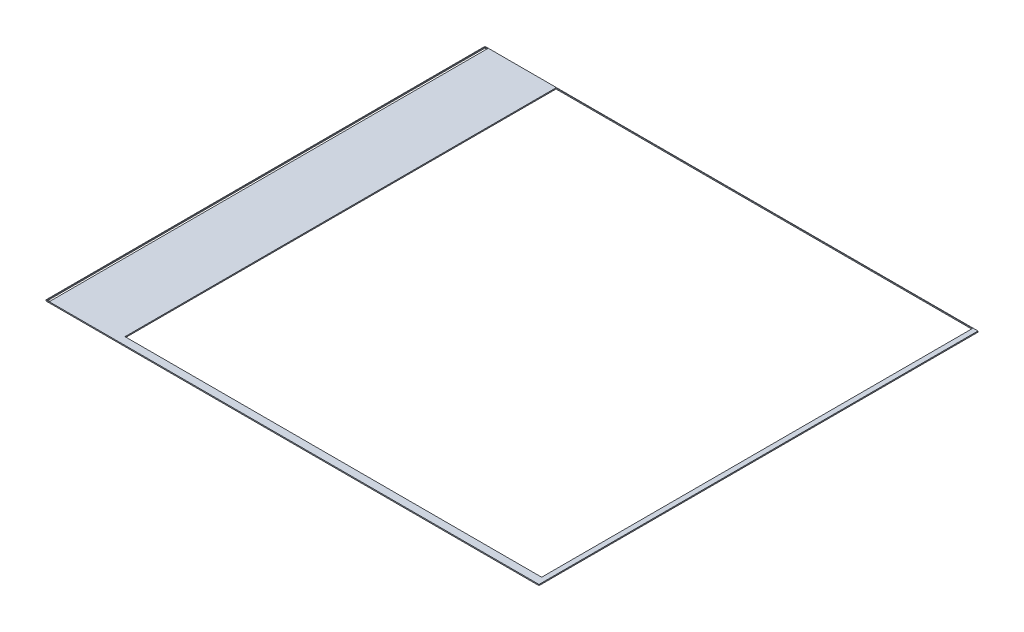
ISO-10303-21;
HEADER;
FILE_DESCRIPTION(('STEP AP214'),'2;1');
FILE_NAME('part.step','',(''),(''),'','','');
FILE_SCHEMA(('AUTOMOTIVE_DESIGN { 1 0 10303 214 1 1 1 1 }'));
ENDSEC;
DATA;
#1=APPLICATION_CONTEXT('core data for automotive mechanical design processes');
#2=APPLICATION_PROTOCOL_DEFINITION('international standard','automotive_design',2000,#1);
#3=PRODUCT_CONTEXT('',#1,'mechanical');
#4=PRODUCT('Part','Part','',(#3));
#5=PRODUCT_RELATED_PRODUCT_CATEGORY('part','',(#4));
#6=PRODUCT_DEFINITION_FORMATION('','',#4);
#7=PRODUCT_DEFINITION_CONTEXT('part definition',#1,'design');
#8=PRODUCT_DEFINITION('design','',#6,#7);
#9=PRODUCT_DEFINITION_SHAPE('','',#8);
#10=(LENGTH_UNIT() NAMED_UNIT(*) SI_UNIT(.MILLI.,.METRE.));
#11=(NAMED_UNIT(*) PLANE_ANGLE_UNIT() SI_UNIT($,.RADIAN.));
#12=(NAMED_UNIT(*) SI_UNIT($,.STERADIAN.) SOLID_ANGLE_UNIT());
#13=UNCERTAINTY_MEASURE_WITH_UNIT(LENGTH_MEASURE(1.E-05),#10,'distance_accuracy_value','');
#14=(GEOMETRIC_REPRESENTATION_CONTEXT(3) GLOBAL_UNCERTAINTY_ASSIGNED_CONTEXT((#13)) GLOBAL_UNIT_ASSIGNED_CONTEXT((#10,
#11,#12)) REPRESENTATION_CONTEXT('',''));
#15=CARTESIAN_POINT('',(0.,0.,0.));
#16=DIRECTION('',(0.,0.,1.));
#17=DIRECTION('',(1.,0.,0.));
#18=AXIS2_PLACEMENT_3D('',#15,#16,#17);
#19=CARTESIAN_POINT('',(-11.365,0.05,-10.12));
#20=DIRECTION('',(1.,0.,0.));
#21=DIRECTION('',(0.,0.,-1.));
#22=AXIS2_PLACEMENT_3D('',#19,#20,#21);
#23=PLANE('',#22);
#24=DIRECTION('',(0.,0.,1.));
#25=VECTOR('',#24,1.);
#26=CARTESIAN_POINT('',(-11.365,0.,-10.12));
#27=LINE('',#26,#25);
#28=CARTESIAN_POINT('',(-11.365,0.,-10.12));
#29=VERTEX_POINT('',#28);
#30=CARTESIAN_POINT('',(-11.365,0.,10.12));
#31=VERTEX_POINT('',#30);
#32=EDGE_CURVE('E182',#29,#31,#27,.T.);
#33=ORIENTED_EDGE('',*,*,#32,.T.);
#34=DIRECTION('',(0.,-1.,0.));
#35=VECTOR('',#34,1.);
#36=CARTESIAN_POINT('',(-11.365,0.05,10.12));
#37=LINE('',#36,#35);
#38=CARTESIAN_POINT('',(-11.365,0.05,10.12));
#39=VERTEX_POINT('',#38);
#40=EDGE_CURVE('E11',#39,#31,#37,.T.);
#41=ORIENTED_EDGE('',*,*,#40,.F.);
#42=DIRECTION('',(0.,0.,1.));
#43=VECTOR('',#42,1.);
#44=CARTESIAN_POINT('',(-11.365,0.05,-10.12));
#45=LINE('',#44,#43);
#46=CARTESIAN_POINT('',(-11.365,0.05,-10.12));
#47=VERTEX_POINT('',#46);
#48=EDGE_CURVE('E189',#47,#39,#45,.T.);
#49=ORIENTED_EDGE('',*,*,#48,.F.);
#50=DIRECTION('',(0.,-1.,0.));
#51=VECTOR('',#50,1.);
#52=CARTESIAN_POINT('',(-11.365,0.05,-10.12));
#53=LINE('',#52,#51);
#54=EDGE_CURVE('E199',#47,#29,#53,.T.);
#55=ORIENTED_EDGE('',*,*,#54,.T.);
#56=EDGE_LOOP('',(#33,#41,#49,#55));
#57=FACE_BOUND('',#56,.T.);
#58=ADVANCED_FACE('F32',(#57),#23,.F.);
#59=CARTESIAN_POINT('',(-11.365,0.05,10.12));
#60=DIRECTION('',(0.,0.,-1.));
#61=DIRECTION('',(-1.,0.,0.));
#62=AXIS2_PLACEMENT_3D('',#59,#60,#61);
#63=PLANE('',#62);
#64=DIRECTION('',(1.,0.,0.));
#65=VECTOR('',#64,1.);
#66=CARTESIAN_POINT('',(-11.365,0.,10.12));
#67=LINE('',#66,#65);
#68=CARTESIAN_POINT('',(11.365,0.,10.12));
#69=VERTEX_POINT('',#68);
#70=EDGE_CURVE('E202',#31,#69,#67,.T.);
#71=ORIENTED_EDGE('',*,*,#70,.T.);
#72=DIRECTION('',(0.,-1.,0.));
#73=VECTOR('',#72,1.);
#74=CARTESIAN_POINT('',(11.365,0.05,10.12));
#75=LINE('',#74,#73);
#76=CARTESIAN_POINT('',(11.365,0.05,10.12));
#77=VERTEX_POINT('',#76);
#78=EDGE_CURVE('E39',#77,#69,#75,.T.);
#79=ORIENTED_EDGE('',*,*,#78,.F.);
#80=DIRECTION('',(1.,0.,0.));
#81=VECTOR('',#80,1.);
#82=CARTESIAN_POINT('',(-11.365,0.05,10.12));
#83=LINE('',#82,#81);
#84=EDGE_CURVE('E192',#39,#77,#83,.T.);
#85=ORIENTED_EDGE('',*,*,#84,.F.);
#86=ORIENTED_EDGE('',*,*,#40,.T.);
#87=EDGE_LOOP('',(#71,#79,#85,#86));
#88=FACE_BOUND('',#87,.T.);
#89=ADVANCED_FACE('F231',(#88),#63,.F.);
#90=CARTESIAN_POINT('',(11.365,0.05,-10.12));
#91=DIRECTION('',(-1.,0.,0.));
#92=DIRECTION('',(0.,0.,1.));
#93=AXIS2_PLACEMENT_3D('',#90,#91,#92);
#94=PLANE('',#93);
#95=DIRECTION('',(0.,0.,-1.));
#96=VECTOR('',#95,1.);
#97=CARTESIAN_POINT('',(11.365,0.,-10.12));
#98=LINE('',#97,#96);
#99=CARTESIAN_POINT('',(11.365,0.,-10.12));
#100=VERTEX_POINT('',#99);
#101=EDGE_CURVE('E204',#69,#100,#98,.T.);
#102=ORIENTED_EDGE('',*,*,#101,.T.);
#103=DIRECTION('',(0.,-1.,0.));
#104=VECTOR('',#103,1.);
#105=CARTESIAN_POINT('',(11.365,0.05,-10.12));
#106=LINE('',#105,#104);
#107=CARTESIAN_POINT('',(11.365,0.05,-10.12));
#108=VERTEX_POINT('',#107);
#109=EDGE_CURVE('E209',#108,#100,#106,.T.);
#110=ORIENTED_EDGE('',*,*,#109,.F.);
#111=DIRECTION('',(0.,0.,-1.));
#112=VECTOR('',#111,1.);
#113=CARTESIAN_POINT('',(11.365,0.05,-10.12));
#114=LINE('',#113,#112);
#115=EDGE_CURVE('E195',#77,#108,#114,.T.);
#116=ORIENTED_EDGE('',*,*,#115,.F.);
#117=ORIENTED_EDGE('',*,*,#78,.T.);
#118=EDGE_LOOP('',(#102,#110,#116,#117));
#119=FACE_BOUND('',#118,.T.);
#120=ADVANCED_FACE('F216',(#119),#94,.F.);
#121=CARTESIAN_POINT('',(-11.365,0.05,-10.12));
#122=DIRECTION('',(0.,0.,1.));
#123=DIRECTION('',(1.,0.,0.));
#124=AXIS2_PLACEMENT_3D('',#121,#122,#123);
#125=PLANE('',#124);
#126=DIRECTION('',(-1.,0.,0.));
#127=VECTOR('',#126,1.);
#128=CARTESIAN_POINT('',(-11.365,0.,-10.12));
#129=LINE('',#128,#127);
#130=EDGE_CURVE('E193',#100,#29,#129,.T.);
#131=ORIENTED_EDGE('',*,*,#130,.T.);
#132=ORIENTED_EDGE('',*,*,#54,.F.);
#133=DIRECTION('',(-1.,0.,0.));
#134=VECTOR('',#133,1.);
#135=CARTESIAN_POINT('',(-11.365,0.05,-10.12));
#136=LINE('',#135,#134);
#137=EDGE_CURVE('E197',#108,#47,#136,.T.);
#138=ORIENTED_EDGE('',*,*,#137,.F.);
#139=ORIENTED_EDGE('',*,*,#109,.T.);
#140=EDGE_LOOP('',(#131,#132,#138,#139));
#141=FACE_BOUND('',#140,.T.);
#142=ADVANCED_FACE('F225',(#141),#125,.F.);
#143=CARTESIAN_POINT('',(-11.365,0.05,10.12));
#144=DIRECTION('',(0.,1.,0.));
#145=DIRECTION('',(0.,0.,1.));
#146=AXIS2_PLACEMENT_3D('',#143,#144,#145);
#147=PLANE('',#146);
#148=DIRECTION('',(0.,0.,-1.));
#149=VECTOR('',#148,1.);
#150=CARTESIAN_POINT('',(-8.0718,0.05,-10.101375));
#151=LINE('',#150,#149);
#152=CARTESIAN_POINT('',(-8.0718,0.05,9.770625));
#153=VERTEX_POINT('',#152);
#154=CARTESIAN_POINT('',(-8.0718,0.05,-10.101375));
#155=VERTEX_POINT('',#154);
#156=EDGE_CURVE('E122',#153,#155,#151,.T.);
#157=ORIENTED_EDGE('',*,*,#156,.T.);
#158=DIRECTION('',(1.,0.,0.));
#159=VECTOR('',#158,1.);
#160=CARTESIAN_POINT('',(11.1378,0.05,-10.101375));
#161=LINE('',#160,#159);
#162=CARTESIAN_POINT('',(11.1378,0.05,-10.101375));
#163=VERTEX_POINT('',#162);
#164=EDGE_CURVE('E131',#155,#163,#161,.T.);
#165=ORIENTED_EDGE('',*,*,#164,.T.);
#166=DIRECTION('',(0.,0.,1.));
#167=VECTOR('',#166,1.);
#168=CARTESIAN_POINT('',(11.1378,0.05,9.770625));
#169=LINE('',#168,#167);
#170=CARTESIAN_POINT('',(11.1378,0.05,9.770625));
#171=VERTEX_POINT('',#170);
#172=EDGE_CURVE('E46',#163,#171,#169,.T.);
#173=ORIENTED_EDGE('',*,*,#172,.T.);
#174=DIRECTION('',(-1.,0.,0.));
#175=VECTOR('',#174,1.);
#176=CARTESIAN_POINT('',(-8.0718,0.05,9.770625));
#177=LINE('',#176,#175);
#178=EDGE_CURVE('E128',#171,#153,#177,.T.);
#179=ORIENTED_EDGE('',*,*,#178,.T.);
#180=EDGE_LOOP('',(#157,#165,#173,#179));
#181=FACE_BOUND('',#180,.T.);
#182=DIRECTION('',(0.,0.,-1.));
#183=VECTOR('',#182,1.);
#184=CARTESIAN_POINT('',(-11.3446,0.05,-10.09685));
#185=LINE('',#184,#183);
#186=CARTESIAN_POINT('',(-11.3446,0.05,10.08815));
#187=VERTEX_POINT('',#186);
#188=CARTESIAN_POINT('',(-11.3446,0.05,-10.09685));
#189=VERTEX_POINT('',#188);
#190=EDGE_CURVE('E157',#187,#189,#185,.T.);
#191=ORIENTED_EDGE('',*,*,#190,.T.);
#192=DIRECTION('',(1.,0.,0.));
#193=VECTOR('',#192,1.);
#194=CARTESIAN_POINT('',(-11.2146,0.05,-10.09685));
#195=LINE('',#194,#193);
#196=CARTESIAN_POINT('',(-11.2146,0.05,-10.09685));
#197=VERTEX_POINT('',#196);
#198=EDGE_CURVE('E160',#189,#197,#195,.T.);
#199=ORIENTED_EDGE('',*,*,#198,.T.);
#200=DIRECTION('',(0.,0.,1.));
#201=VECTOR('',#200,1.);
#202=CARTESIAN_POINT('',(-11.2146,0.05,10.08815));
#203=LINE('',#202,#201);
#204=CARTESIAN_POINT('',(-11.2146,0.05,10.08815));
#205=VERTEX_POINT('',#204);
#206=EDGE_CURVE('E164',#197,#205,#203,.T.);
#207=ORIENTED_EDGE('',*,*,#206,.T.);
#208=DIRECTION('',(-1.,0.,0.));
#209=VECTOR('',#208,1.);
#210=CARTESIAN_POINT('',(-11.3446,0.05,10.08815));
#211=LINE('',#210,#209);
#212=EDGE_CURVE('E167',#205,#187,#211,.T.);
#213=ORIENTED_EDGE('',*,*,#212,.T.);
#214=EDGE_LOOP('',(#191,#199,#207,#213));
#215=FACE_BOUND('',#214,.T.);
#216=ORIENTED_EDGE('',*,*,#48,.T.);
#217=ORIENTED_EDGE('',*,*,#84,.T.);
#218=ORIENTED_EDGE('',*,*,#115,.T.);
#219=ORIENTED_EDGE('',*,*,#137,.T.);
#220=EDGE_LOOP('',(#216,#217,#218,#219));
#221=FACE_BOUND('',#220,.T.);
#222=ADVANCED_FACE('F135',(#181,#215,#221),#147,.T.);
#223=CARTESIAN_POINT('',(-11.365,0.,10.12));
#224=DIRECTION('',(0.,1.,0.));
#225=DIRECTION('',(0.,0.,1.));
#226=AXIS2_PLACEMENT_3D('',#223,#224,#225);
#227=PLANE('',#226);
#228=DIRECTION('',(1.,0.,0.));
#229=VECTOR('',#228,1.);
#230=CARTESIAN_POINT('',(11.1378,0.,-10.101375));
#231=LINE('',#230,#229);
#232=CARTESIAN_POINT('',(-8.0718,0.,-10.101375));
#233=VERTEX_POINT('',#232);
#234=CARTESIAN_POINT('',(11.1378,0.,-10.101375));
#235=VERTEX_POINT('',#234);
#236=EDGE_CURVE('E147',#233,#235,#231,.T.);
#237=ORIENTED_EDGE('',*,*,#236,.F.);
#238=DIRECTION('',(0.,0.,-1.));
#239=VECTOR('',#238,1.);
#240=CARTESIAN_POINT('',(-8.0718,0.,-10.101375));
#241=LINE('',#240,#239);
#242=CARTESIAN_POINT('',(-8.0718,0.,9.770625));
#243=VERTEX_POINT('',#242);
#244=EDGE_CURVE('E54',#243,#233,#241,.T.);
#245=ORIENTED_EDGE('',*,*,#244,.F.);
#246=DIRECTION('',(-1.,0.,0.));
#247=VECTOR('',#246,1.);
#248=CARTESIAN_POINT('',(-8.0718,0.,9.770625));
#249=LINE('',#248,#247);
#250=CARTESIAN_POINT('',(11.1378,0.,9.770625));
#251=VERTEX_POINT('',#250);
#252=EDGE_CURVE('E138',#251,#243,#249,.T.);
#253=ORIENTED_EDGE('',*,*,#252,.F.);
#254=DIRECTION('',(0.,0.,1.));
#255=VECTOR('',#254,1.);
#256=CARTESIAN_POINT('',(11.1378,0.,9.770625));
#257=LINE('',#256,#255);
#258=EDGE_CURVE('E141',#235,#251,#257,.T.);
#259=ORIENTED_EDGE('',*,*,#258,.F.);
#260=EDGE_LOOP('',(#237,#245,#253,#259));
#261=FACE_BOUND('',#260,.T.);
#262=DIRECTION('',(1.,0.,0.));
#263=VECTOR('',#262,1.);
#264=CARTESIAN_POINT('',(-11.2146,0.,-10.09685));
#265=LINE('',#264,#263);
#266=CARTESIAN_POINT('',(-11.3446,0.,-10.09685));
#267=VERTEX_POINT('',#266);
#268=CARTESIAN_POINT('',(-11.2146,0.,-10.09685));
#269=VERTEX_POINT('',#268);
#270=EDGE_CURVE('E172',#267,#269,#265,.T.);
#271=ORIENTED_EDGE('',*,*,#270,.F.);
#272=DIRECTION('',(0.,0.,-1.));
#273=VECTOR('',#272,1.);
#274=CARTESIAN_POINT('',(-11.3446,0.,-10.09685));
#275=LINE('',#274,#273);
#276=CARTESIAN_POINT('',(-11.3446,0.,10.08815));
#277=VERTEX_POINT('',#276);
#278=EDGE_CURVE('E153',#277,#267,#275,.T.);
#279=ORIENTED_EDGE('',*,*,#278,.F.);
#280=DIRECTION('',(-1.,0.,0.));
#281=VECTOR('',#280,1.);
#282=CARTESIAN_POINT('',(-11.3446,0.,10.08815));
#283=LINE('',#282,#281);
#284=CARTESIAN_POINT('',(-11.2146,0.,10.08815));
#285=VERTEX_POINT('',#284);
#286=EDGE_CURVE('E161',#285,#277,#283,.T.);
#287=ORIENTED_EDGE('',*,*,#286,.F.);
#288=DIRECTION('',(0.,0.,1.));
#289=VECTOR('',#288,1.);
#290=CARTESIAN_POINT('',(-11.2146,0.,10.08815));
#291=LINE('',#290,#289);
#292=EDGE_CURVE('E175',#269,#285,#291,.T.);
#293=ORIENTED_EDGE('',*,*,#292,.F.);
#294=EDGE_LOOP('',(#271,#279,#287,#293));
#295=FACE_BOUND('',#294,.T.);
#296=ORIENTED_EDGE('',*,*,#32,.F.);
#297=ORIENTED_EDGE('',*,*,#130,.F.);
#298=ORIENTED_EDGE('',*,*,#101,.F.);
#299=ORIENTED_EDGE('',*,*,#70,.F.);
#300=EDGE_LOOP('',(#296,#297,#298,#299));
#301=FACE_BOUND('',#300,.T.);
#302=ADVANCED_FACE('F222',(#261,#295,#301),#227,.F.);
#303=CARTESIAN_POINT('',(-11.3446,0.05,-10.09685));
#304=DIRECTION('',(-1.,0.,0.));
#305=DIRECTION('',(0.,0.,1.));
#306=AXIS2_PLACEMENT_3D('',#303,#304,#305);
#307=PLANE('',#306);
#308=ORIENTED_EDGE('',*,*,#278,.T.);
#309=DIRECTION('',(0.,-1.,0.));
#310=VECTOR('',#309,1.);
#311=CARTESIAN_POINT('',(-11.3446,0.05,-10.09685));
#312=LINE('',#311,#310);
#313=EDGE_CURVE('E170',#189,#267,#312,.T.);
#314=ORIENTED_EDGE('',*,*,#313,.F.);
#315=ORIENTED_EDGE('',*,*,#190,.F.);
#316=DIRECTION('',(0.,-1.,0.));
#317=VECTOR('',#316,1.);
#318=CARTESIAN_POINT('',(-11.3446,0.05,10.08815));
#319=LINE('',#318,#317);
#320=EDGE_CURVE('E180',#187,#277,#319,.T.);
#321=ORIENTED_EDGE('',*,*,#320,.T.);
#322=EDGE_LOOP('',(#308,#314,#315,#321));
#323=FACE_BOUND('',#322,.T.);
#324=ADVANCED_FACE('F243',(#323),#307,.F.);
#325=CARTESIAN_POINT('',(-11.3446,0.05,10.08815));
#326=DIRECTION('',(0.,0.,1.));
#327=DIRECTION('',(1.,0.,0.));
#328=AXIS2_PLACEMENT_3D('',#325,#326,#327);
#329=PLANE('',#328);
#330=ORIENTED_EDGE('',*,*,#286,.T.);
#331=ORIENTED_EDGE('',*,*,#320,.F.);
#332=ORIENTED_EDGE('',*,*,#212,.F.);
#333=DIRECTION('',(0.,-1.,0.));
#334=VECTOR('',#333,1.);
#335=CARTESIAN_POINT('',(-11.2146,0.05,10.08815));
#336=LINE('',#335,#334);
#337=EDGE_CURVE('E183',#205,#285,#336,.T.);
#338=ORIENTED_EDGE('',*,*,#337,.T.);
#339=EDGE_LOOP('',(#330,#331,#332,#338));
#340=FACE_BOUND('',#339,.T.);
#341=ADVANCED_FACE('F249',(#340),#329,.F.);
#342=CARTESIAN_POINT('',(-11.2146,0.05,10.08815));
#343=DIRECTION('',(1.,0.,0.));
#344=DIRECTION('',(0.,0.,-1.));
#345=AXIS2_PLACEMENT_3D('',#342,#343,#344);
#346=PLANE('',#345);
#347=ORIENTED_EDGE('',*,*,#292,.T.);
#348=ORIENTED_EDGE('',*,*,#337,.F.);
#349=ORIENTED_EDGE('',*,*,#206,.F.);
#350=DIRECTION('',(0.,-1.,0.));
#351=VECTOR('',#350,1.);
#352=CARTESIAN_POINT('',(-11.2146,0.05,-10.09685));
#353=LINE('',#352,#351);
#354=EDGE_CURVE('E185',#197,#269,#353,.T.);
#355=ORIENTED_EDGE('',*,*,#354,.T.);
#356=EDGE_LOOP('',(#347,#348,#349,#355));
#357=FACE_BOUND('',#356,.T.);
#358=ADVANCED_FACE('F254',(#357),#346,.F.);
#359=CARTESIAN_POINT('',(-11.2146,0.05,-10.09685));
#360=DIRECTION('',(0.,0.,-1.));
#361=DIRECTION('',(-1.,0.,0.));
#362=AXIS2_PLACEMENT_3D('',#359,#360,#361);
#363=PLANE('',#362);
#364=ORIENTED_EDGE('',*,*,#270,.T.);
#365=ORIENTED_EDGE('',*,*,#354,.F.);
#366=ORIENTED_EDGE('',*,*,#198,.F.);
#367=ORIENTED_EDGE('',*,*,#313,.T.);
#368=EDGE_LOOP('',(#364,#365,#366,#367));
#369=FACE_BOUND('',#368,.T.);
#370=ADVANCED_FACE('F251',(#369),#363,.F.);
#371=CARTESIAN_POINT('',(-8.0718,0.05,-10.101375));
#372=DIRECTION('',(-1.,0.,0.));
#373=DIRECTION('',(0.,0.,1.));
#374=AXIS2_PLACEMENT_3D('',#371,#372,#373);
#375=PLANE('',#374);
#376=ORIENTED_EDGE('',*,*,#244,.T.);
#377=DIRECTION('',(0.,-1.,0.));
#378=VECTOR('',#377,1.);
#379=CARTESIAN_POINT('',(-8.0718,0.05,-10.101375));
#380=LINE('',#379,#378);
#381=EDGE_CURVE('E118',#155,#233,#380,.T.);
#382=ORIENTED_EDGE('',*,*,#381,.F.);
#383=ORIENTED_EDGE('',*,*,#156,.F.);
#384=DIRECTION('',(0.,-1.,0.));
#385=VECTOR('',#384,1.);
#386=CARTESIAN_POINT('',(-8.0718,0.05,9.770625));
#387=LINE('',#386,#385);
#388=EDGE_CURVE('E151',#153,#243,#387,.T.);
#389=ORIENTED_EDGE('',*,*,#388,.T.);
#390=EDGE_LOOP('',(#376,#382,#383,#389));
#391=FACE_BOUND('',#390,.T.);
#392=ADVANCED_FACE('F120',(#391),#375,.F.);
#393=CARTESIAN_POINT('',(-8.0718,0.05,9.770625));
#394=DIRECTION('',(0.,0.,1.));
#395=DIRECTION('',(1.,0.,0.));
#396=AXIS2_PLACEMENT_3D('',#393,#394,#395);
#397=PLANE('',#396);
#398=ORIENTED_EDGE('',*,*,#252,.T.);
#399=ORIENTED_EDGE('',*,*,#388,.F.);
#400=ORIENTED_EDGE('',*,*,#178,.F.);
#401=DIRECTION('',(0.,-1.,0.));
#402=VECTOR('',#401,1.);
#403=CARTESIAN_POINT('',(11.1378,0.05,9.770625));
#404=LINE('',#403,#402);
#405=EDGE_CURVE('E154',#171,#251,#404,.T.);
#406=ORIENTED_EDGE('',*,*,#405,.T.);
#407=EDGE_LOOP('',(#398,#399,#400,#406));
#408=FACE_BOUND('',#407,.T.);
#409=ADVANCED_FACE('F264',(#408),#397,.F.);
#410=CARTESIAN_POINT('',(11.1378,0.05,9.770625));
#411=DIRECTION('',(1.,0.,0.));
#412=DIRECTION('',(0.,0.,-1.));
#413=AXIS2_PLACEMENT_3D('',#410,#411,#412);
#414=PLANE('',#413);
#415=ORIENTED_EDGE('',*,*,#258,.T.);
#416=ORIENTED_EDGE('',*,*,#405,.F.);
#417=ORIENTED_EDGE('',*,*,#172,.F.);
#418=DIRECTION('',(0.,-1.,0.));
#419=VECTOR('',#418,1.);
#420=CARTESIAN_POINT('',(11.1378,0.05,-10.101375));
#421=LINE('',#420,#419);
#422=EDGE_CURVE('E127',#163,#235,#421,.T.);
#423=ORIENTED_EDGE('',*,*,#422,.T.);
#424=EDGE_LOOP('',(#415,#416,#417,#423));
#425=FACE_BOUND('',#424,.T.);
#426=ADVANCED_FACE('F267',(#425),#414,.F.);
#427=CARTESIAN_POINT('',(11.1378,0.05,-10.101375));
#428=DIRECTION('',(0.,0.,-1.));
#429=DIRECTION('',(-1.,0.,0.));
#430=AXIS2_PLACEMENT_3D('',#427,#428,#429);
#431=PLANE('',#430);
#432=ORIENTED_EDGE('',*,*,#236,.T.);
#433=ORIENTED_EDGE('',*,*,#422,.F.);
#434=ORIENTED_EDGE('',*,*,#164,.F.);
#435=ORIENTED_EDGE('',*,*,#381,.T.);
#436=EDGE_LOOP('',(#432,#433,#434,#435));
#437=FACE_BOUND('',#436,.T.);
#438=ADVANCED_FACE('F132',(#437),#431,.F.);
#439=CLOSED_SHELL('',(#58,#89,#120,#142,#222,#302,#324,#341,#358,#370,#392,#409,#426,#438));
#440=MANIFOLD_SOLID_BREP('B2',#439);
#441=ADVANCED_BREP_SHAPE_REPRESENTATION('',(#18,#440),#14);
#442=SHAPE_DEFINITION_REPRESENTATION(#9,#441);
ENDSEC;
END-ISO-10303-21;
